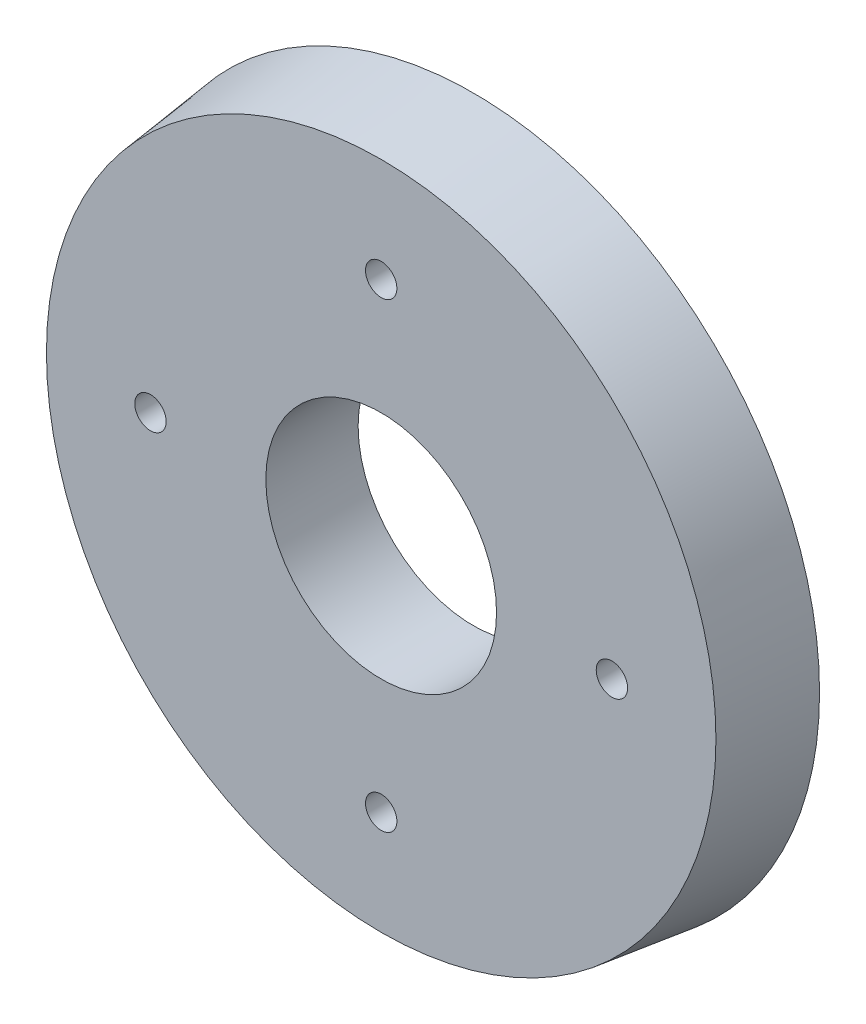
ISO-10303-21;
HEADER;
FILE_DESCRIPTION(('STEP AP214'),'2;1');
FILE_NAME('part.step','',(''),(''),'','','');
FILE_SCHEMA(('AUTOMOTIVE_DESIGN { 1 0 10303 214 1 1 1 1 }'));
ENDSEC;
DATA;
#1=APPLICATION_CONTEXT('core data for automotive mechanical design processes');
#2=APPLICATION_PROTOCOL_DEFINITION('international standard','automotive_design',2000,#1);
#3=PRODUCT_CONTEXT('',#1,'mechanical');
#4=PRODUCT('Part','Part','',(#3));
#5=PRODUCT_RELATED_PRODUCT_CATEGORY('part','',(#4));
#6=PRODUCT_DEFINITION_FORMATION('','',#4);
#7=PRODUCT_DEFINITION_CONTEXT('part definition',#1,'design');
#8=PRODUCT_DEFINITION('design','',#6,#7);
#9=PRODUCT_DEFINITION_SHAPE('','',#8);
#10=(LENGTH_UNIT() NAMED_UNIT(*) SI_UNIT(.MILLI.,.METRE.));
#11=(NAMED_UNIT(*) PLANE_ANGLE_UNIT() SI_UNIT($,.RADIAN.));
#12=(NAMED_UNIT(*) SI_UNIT($,.STERADIAN.) SOLID_ANGLE_UNIT());
#13=UNCERTAINTY_MEASURE_WITH_UNIT(LENGTH_MEASURE(1.E-05),#10,'distance_accuracy_value','');
#14=(GEOMETRIC_REPRESENTATION_CONTEXT(3) GLOBAL_UNCERTAINTY_ASSIGNED_CONTEXT((#13)) GLOBAL_UNIT_ASSIGNED_CONTEXT((#10,
#11,#12)) REPRESENTATION_CONTEXT('',''));
#15=CARTESIAN_POINT('',(0.,0.,0.));
#16=DIRECTION('',(0.,0.,1.));
#17=DIRECTION('',(1.,0.,0.));
#18=AXIS2_PLACEMENT_3D('',#15,#16,#17);
#19=CARTESIAN_POINT('',(0.,0.,0.));
#20=DIRECTION('',(0.,0.,-1.));
#21=DIRECTION('',(1.,0.,0.));
#22=AXIS2_PLACEMENT_3D('',#19,#20,#21);
#23=CONICAL_SURFACE('',#22,75.,0.122173047639603);
#24=CARTESIAN_POINT('',(0.,0.,20.));
#25=DIRECTION('',(0.,0.,1.));
#26=DIRECTION('',(1.,0.,0.));
#27=AXIS2_PLACEMENT_3D('',#24,#25,#26);
#28=CIRCLE('',#27,72.5443087819419);
#29=CARTESIAN_POINT('',(72.5443087819419,0.,20.));
#30=VERTEX_POINT('',#29);
#31=EDGE_CURVE('E10',#30,#30,#28,.T.);
#32=ORIENTED_EDGE('',*,*,#31,.F.);
#33=EDGE_LOOP('',(#32));
#34=FACE_BOUND('',#33,.T.);
#35=CARTESIAN_POINT('',(0.,0.,0.));
#36=DIRECTION('',(0.,0.,1.));
#37=DIRECTION('',(1.,0.,0.));
#38=AXIS2_PLACEMENT_3D('',#35,#36,#37);
#39=CIRCLE('',#38,75.);
#40=CARTESIAN_POINT('',(75.,0.,0.));
#41=VERTEX_POINT('',#40);
#42=EDGE_CURVE('E37',#41,#41,#39,.T.);
#43=ORIENTED_EDGE('',*,*,#42,.T.);
#44=EDGE_LOOP('',(#43));
#45=FACE_BOUND('',#44,.T.);
#46=ADVANCED_FACE('F31',(#34,#45),#23,.T.);
#47=CARTESIAN_POINT('',(0.,0.,20.));
#48=DIRECTION('',(0.,0.,1.));
#49=DIRECTION('',(1.,0.,0.));
#50=AXIS2_PLACEMENT_3D('',#47,#48,#49);
#51=PLANE('',#50);
#52=CARTESIAN_POINT('',(0.,50.,20.));
#53=DIRECTION('',(0.,0.,-1.));
#54=DIRECTION('',(-1.,0.,0.));
#55=AXIS2_PLACEMENT_3D('',#52,#53,#54);
#56=CIRCLE('',#55,3.4);
#57=CARTESIAN_POINT('',(-3.4,50.,20.));
#58=VERTEX_POINT('',#57);
#59=EDGE_CURVE('E49',#58,#58,#56,.T.);
#60=ORIENTED_EDGE('',*,*,#59,.T.);
#61=EDGE_LOOP('',(#60));
#62=FACE_BOUND('',#61,.T.);
#63=CARTESIAN_POINT('',(-50.0000000000017,1.69366842123234E-12,20.));
#64=DIRECTION('',(0.,0.,-1.));
#65=DIRECTION('',(-1.,0.,0.));
#66=AXIS2_PLACEMENT_3D('',#63,#64,#65);
#67=CIRCLE('',#66,3.4);
#68=CARTESIAN_POINT('',(-53.4000000000017,1.69366842123234E-12,20.));
#69=VERTEX_POINT('',#68);
#70=EDGE_CURVE('E54',#69,#69,#67,.T.);
#71=ORIENTED_EDGE('',*,*,#70,.T.);
#72=EDGE_LOOP('',(#71));
#73=FACE_BOUND('',#72,.T.);
#74=CARTESIAN_POINT('',(-3.38733684246468E-12,-50.,20.));
#75=DIRECTION('',(0.,0.,-1.));
#76=DIRECTION('',(-1.,0.,0.));
#77=AXIS2_PLACEMENT_3D('',#74,#75,#76);
#78=CIRCLE('',#77,3.4);
#79=CARTESIAN_POINT('',(-3.40000000000339,-50.,20.));
#80=VERTEX_POINT('',#79);
#81=EDGE_CURVE('E55',#80,#80,#78,.T.);
#82=ORIENTED_EDGE('',*,*,#81,.T.);
#83=EDGE_LOOP('',(#82));
#84=FACE_BOUND('',#83,.T.);
#85=CARTESIAN_POINT('',(49.9999999999983,-1.69979165522808E-12,20.));
#86=DIRECTION('',(0.,0.,-1.));
#87=DIRECTION('',(-1.,0.,0.));
#88=AXIS2_PLACEMENT_3D('',#85,#86,#87);
#89=CIRCLE('',#88,3.4);
#90=CARTESIAN_POINT('',(46.5999999999983,-1.69979165522808E-12,20.));
#91=VERTEX_POINT('',#90);
#92=EDGE_CURVE('E66',#91,#91,#89,.T.);
#93=ORIENTED_EDGE('',*,*,#92,.T.);
#94=EDGE_LOOP('',(#93));
#95=FACE_BOUND('',#94,.T.);
#96=CARTESIAN_POINT('',(0.,0.,20.));
#97=DIRECTION('',(0.,0.,-1.));
#98=DIRECTION('',(-1.,0.,0.));
#99=AXIS2_PLACEMENT_3D('',#96,#97,#98);
#100=CIRCLE('',#99,25.);
#101=CARTESIAN_POINT('',(-25.,0.,20.));
#102=VERTEX_POINT('',#101);
#103=EDGE_CURVE('E41',#102,#102,#100,.T.);
#104=ORIENTED_EDGE('',*,*,#103,.T.);
#105=EDGE_LOOP('',(#104));
#106=FACE_BOUND('',#105,.T.);
#107=ORIENTED_EDGE('',*,*,#31,.T.);
#108=EDGE_LOOP('',(#107));
#109=FACE_BOUND('',#108,.T.);
#110=ADVANCED_FACE('F75',(#62,#73,#84,#95,#106,#109),#51,.T.);
#111=CARTESIAN_POINT('',(0.,0.,0.));
#112=DIRECTION('',(0.,0.,1.));
#113=DIRECTION('',(1.,0.,0.));
#114=AXIS2_PLACEMENT_3D('',#111,#112,#113);
#115=PLANE('',#114);
#116=CARTESIAN_POINT('',(0.,50.,0.));
#117=DIRECTION('',(0.,0.,-1.));
#118=DIRECTION('',(-1.,0.,0.));
#119=AXIS2_PLACEMENT_3D('',#116,#117,#118);
#120=CIRCLE('',#119,3.4);
#121=CARTESIAN_POINT('',(-3.4,50.,0.));
#122=VERTEX_POINT('',#121);
#123=EDGE_CURVE('E58',#122,#122,#120,.T.);
#124=ORIENTED_EDGE('',*,*,#123,.F.);
#125=EDGE_LOOP('',(#124));
#126=FACE_BOUND('',#125,.T.);
#127=CARTESIAN_POINT('',(-50.0000000000017,1.69366842123234E-12,0.));
#128=DIRECTION('',(0.,0.,-1.));
#129=DIRECTION('',(-1.,0.,0.));
#130=AXIS2_PLACEMENT_3D('',#127,#128,#129);
#131=CIRCLE('',#130,3.4);
#132=CARTESIAN_POINT('',(-53.4000000000017,1.69366842123234E-12,0.));
#133=VERTEX_POINT('',#132);
#134=EDGE_CURVE('E51',#133,#133,#131,.T.);
#135=ORIENTED_EDGE('',*,*,#134,.F.);
#136=EDGE_LOOP('',(#135));
#137=FACE_BOUND('',#136,.T.);
#138=CARTESIAN_POINT('',(-3.38733684246468E-12,-50.,0.));
#139=DIRECTION('',(0.,0.,-1.));
#140=DIRECTION('',(-1.,0.,0.));
#141=AXIS2_PLACEMENT_3D('',#138,#139,#140);
#142=CIRCLE('',#141,3.4);
#143=CARTESIAN_POINT('',(-3.40000000000339,-50.,0.));
#144=VERTEX_POINT('',#143);
#145=EDGE_CURVE('E69',#144,#144,#142,.T.);
#146=ORIENTED_EDGE('',*,*,#145,.F.);
#147=EDGE_LOOP('',(#146));
#148=FACE_BOUND('',#147,.T.);
#149=CARTESIAN_POINT('',(49.9999999999983,-1.69979165522808E-12,0.));
#150=DIRECTION('',(0.,0.,-1.));
#151=DIRECTION('',(-1.,0.,0.));
#152=AXIS2_PLACEMENT_3D('',#149,#150,#151);
#153=CIRCLE('',#152,3.4);
#154=CARTESIAN_POINT('',(46.5999999999983,-1.69979165522808E-12,0.));
#155=VERTEX_POINT('',#154);
#156=EDGE_CURVE('E63',#155,#155,#153,.T.);
#157=ORIENTED_EDGE('',*,*,#156,.F.);
#158=EDGE_LOOP('',(#157));
#159=FACE_BOUND('',#158,.T.);
#160=CARTESIAN_POINT('',(0.,0.,0.));
#161=DIRECTION('',(0.,0.,-1.));
#162=DIRECTION('',(-1.,0.,0.));
#163=AXIS2_PLACEMENT_3D('',#160,#161,#162);
#164=CIRCLE('',#163,25.);
#165=CARTESIAN_POINT('',(-25.,0.,0.));
#166=VERTEX_POINT('',#165);
#167=EDGE_CURVE('E45',#166,#166,#164,.T.);
#168=ORIENTED_EDGE('',*,*,#167,.F.);
#169=EDGE_LOOP('',(#168));
#170=FACE_BOUND('',#169,.T.);
#171=ORIENTED_EDGE('',*,*,#42,.F.);
#172=EDGE_LOOP('',(#171));
#173=FACE_BOUND('',#172,.T.);
#174=ADVANCED_FACE('F86',(#126,#137,#148,#159,#170,#173),#115,.F.);
#175=CARTESIAN_POINT('',(0.,0.,20.));
#176=DIRECTION('',(0.,0.,-1.));
#177=DIRECTION('',(-1.,0.,0.));
#178=AXIS2_PLACEMENT_3D('',#175,#176,#177);
#179=CYLINDRICAL_SURFACE('',#178,25.);
#180=ORIENTED_EDGE('',*,*,#103,.F.);
#181=EDGE_LOOP('',(#180));
#182=FACE_BOUND('',#181,.T.);
#183=ORIENTED_EDGE('',*,*,#167,.T.);
#184=EDGE_LOOP('',(#183));
#185=FACE_BOUND('',#184,.T.);
#186=ADVANCED_FACE('F89',(#182,#185),#179,.F.);
#187=CARTESIAN_POINT('',(49.9999999999983,-1.69979165522808E-12,20.));
#188=DIRECTION('',(0.,0.,-1.));
#189=DIRECTION('',(-1.,0.,0.));
#190=AXIS2_PLACEMENT_3D('',#187,#188,#189);
#191=CYLINDRICAL_SURFACE('',#190,3.4);
#192=ORIENTED_EDGE('',*,*,#92,.F.);
#193=EDGE_LOOP('',(#192));
#194=FACE_BOUND('',#193,.T.);
#195=ORIENTED_EDGE('',*,*,#156,.T.);
#196=EDGE_LOOP('',(#195));
#197=FACE_BOUND('',#196,.T.);
#198=ADVANCED_FACE('F82',(#194,#197),#191,.F.);
#199=CARTESIAN_POINT('',(-3.38733684246468E-12,-50.,20.));
#200=DIRECTION('',(0.,0.,-1.));
#201=DIRECTION('',(-1.,0.,0.));
#202=AXIS2_PLACEMENT_3D('',#199,#200,#201);
#203=CYLINDRICAL_SURFACE('',#202,3.4);
#204=ORIENTED_EDGE('',*,*,#81,.F.);
#205=EDGE_LOOP('',(#204));
#206=FACE_BOUND('',#205,.T.);
#207=ORIENTED_EDGE('',*,*,#145,.T.);
#208=EDGE_LOOP('',(#207));
#209=FACE_BOUND('',#208,.T.);
#210=ADVANCED_FACE('F78',(#206,#209),#203,.F.);
#211=CARTESIAN_POINT('',(-50.0000000000017,1.69366842123234E-12,20.));
#212=DIRECTION('',(0.,0.,-1.));
#213=DIRECTION('',(-1.,0.,0.));
#214=AXIS2_PLACEMENT_3D('',#211,#212,#213);
#215=CYLINDRICAL_SURFACE('',#214,3.4);
#216=ORIENTED_EDGE('',*,*,#70,.F.);
#217=EDGE_LOOP('',(#216));
#218=FACE_BOUND('',#217,.T.);
#219=ORIENTED_EDGE('',*,*,#134,.T.);
#220=EDGE_LOOP('',(#219));
#221=FACE_BOUND('',#220,.T.);
#222=ADVANCED_FACE('F81',(#218,#221),#215,.F.);
#223=CARTESIAN_POINT('',(0.,50.,20.));
#224=DIRECTION('',(0.,0.,-1.));
#225=DIRECTION('',(-1.,0.,0.));
#226=AXIS2_PLACEMENT_3D('',#223,#224,#225);
#227=CYLINDRICAL_SURFACE('',#226,3.4);
#228=ORIENTED_EDGE('',*,*,#59,.F.);
#229=EDGE_LOOP('',(#228));
#230=FACE_BOUND('',#229,.T.);
#231=ORIENTED_EDGE('',*,*,#123,.T.);
#232=EDGE_LOOP('',(#231));
#233=FACE_BOUND('',#232,.T.);
#234=ADVANCED_FACE('F121',(#230,#233),#227,.F.);
#235=CLOSED_SHELL('',(#46,#110,#174,#186,#198,#210,#222,#234));
#236=MANIFOLD_SOLID_BREP('B2',#235);
#237=ADVANCED_BREP_SHAPE_REPRESENTATION('',(#18,#236),#14);
#238=SHAPE_DEFINITION_REPRESENTATION(#9,#237);
ENDSEC;
END-ISO-10303-21;
